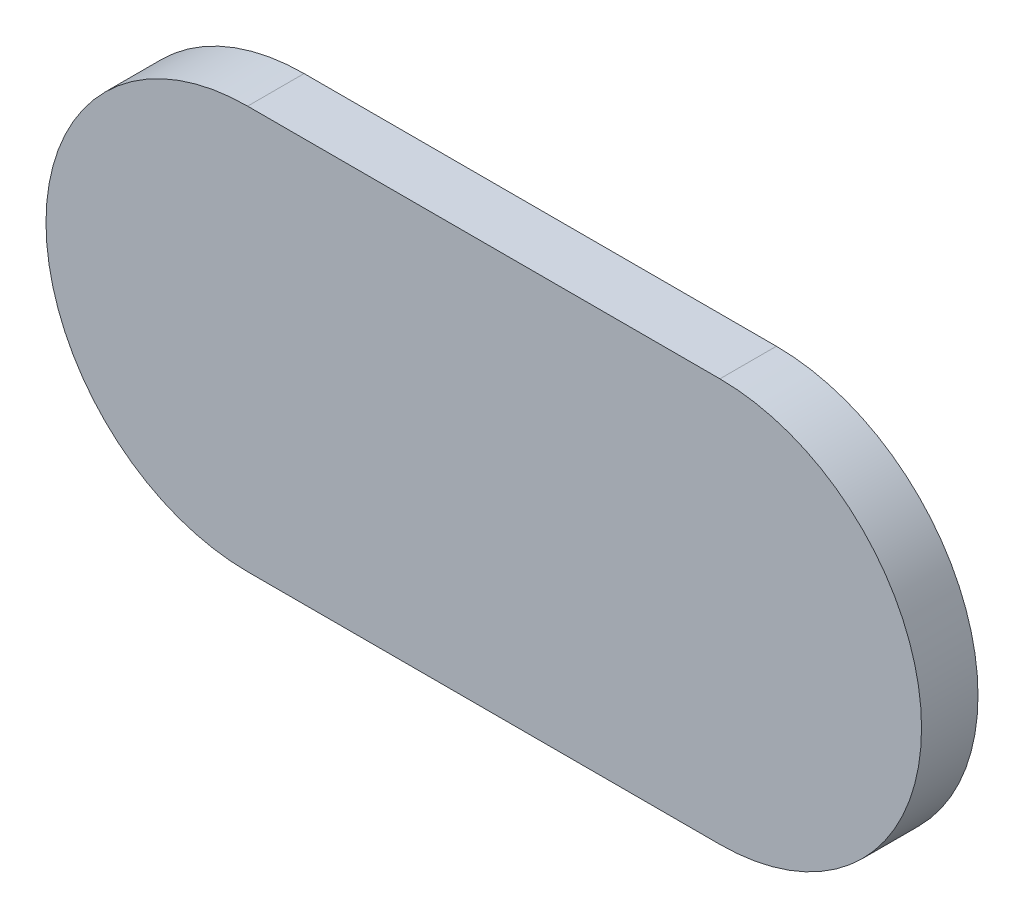
ISO-10303-21;
HEADER;
FILE_DESCRIPTION(('STEP AP214'),'2;1');
FILE_NAME('part.step','',(''),(''),'','','');
FILE_SCHEMA(('AUTOMOTIVE_DESIGN { 1 0 10303 214 1 1 1 1 }'));
ENDSEC;
DATA;
#1=APPLICATION_CONTEXT('core data for automotive mechanical design processes');
#2=APPLICATION_PROTOCOL_DEFINITION('international standard','automotive_design',2000,#1);
#3=PRODUCT_CONTEXT('',#1,'mechanical');
#4=PRODUCT('Part','Part','',(#3));
#5=PRODUCT_RELATED_PRODUCT_CATEGORY('part','',(#4));
#6=PRODUCT_DEFINITION_FORMATION('','',#4);
#7=PRODUCT_DEFINITION_CONTEXT('part definition',#1,'design');
#8=PRODUCT_DEFINITION('design','',#6,#7);
#9=PRODUCT_DEFINITION_SHAPE('','',#8);
#10=(LENGTH_UNIT() NAMED_UNIT(*) SI_UNIT(.MILLI.,.METRE.));
#11=(NAMED_UNIT(*) PLANE_ANGLE_UNIT() SI_UNIT($,.RADIAN.));
#12=(NAMED_UNIT(*) SI_UNIT($,.STERADIAN.) SOLID_ANGLE_UNIT());
#13=UNCERTAINTY_MEASURE_WITH_UNIT(LENGTH_MEASURE(1.E-05),#10,'distance_accuracy_value','');
#14=(GEOMETRIC_REPRESENTATION_CONTEXT(3) GLOBAL_UNCERTAINTY_ASSIGNED_CONTEXT((#13)) GLOBAL_UNIT_ASSIGNED_CONTEXT((#10,
#11,#12)) REPRESENTATION_CONTEXT('',''));
#15=CARTESIAN_POINT('',(0.,0.,0.));
#16=DIRECTION('',(0.,0.,1.));
#17=DIRECTION('',(1.,0.,0.));
#18=AXIS2_PLACEMENT_3D('',#15,#16,#17);
#19=CARTESIAN_POINT('',(86.92152796,101.0600468,0.));
#20=DIRECTION('',(0.,1.,0.));
#21=DIRECTION('',(1.,0.,0.));
#22=AXIS2_PLACEMENT_3D('',#19,#20,#21);
#23=PLANE('',#22);
#24=DIRECTION('',(1.,0.,0.));
#25=VECTOR('',#24,1.);
#26=CARTESIAN_POINT('',(86.92152796,101.0600468,0.03556));
#27=LINE('',#26,#25);
#28=CARTESIAN_POINT('',(86.92152796,101.0600468,0.03556));
#29=VERTEX_POINT('',#28);
#30=CARTESIAN_POINT('',(87.219028,101.0600468,0.03556));
#31=VERTEX_POINT('',#30);
#32=EDGE_CURVE('E11',#29,#31,#27,.T.);
#33=ORIENTED_EDGE('',*,*,#32,.F.);
#34=DIRECTION('',(0.,0.,1.));
#35=VECTOR('',#34,1.);
#36=CARTESIAN_POINT('',(86.92152796,101.0600468,0.));
#37=LINE('',#36,#35);
#38=CARTESIAN_POINT('',(86.92152796,101.0600468,0.));
#39=VERTEX_POINT('',#38);
#40=EDGE_CURVE('E24',#39,#29,#37,.T.);
#41=ORIENTED_EDGE('',*,*,#40,.F.);
#42=DIRECTION('',(1.,0.,0.));
#43=VECTOR('',#42,1.);
#44=CARTESIAN_POINT('',(86.92152796,101.0600468,0.));
#45=LINE('',#44,#43);
#46=CARTESIAN_POINT('',(87.219028,101.0600468,0.));
#47=VERTEX_POINT('',#46);
#48=EDGE_CURVE('E75',#39,#47,#45,.T.);
#49=ORIENTED_EDGE('',*,*,#48,.T.);
#50=DIRECTION('',(0.,0.,1.));
#51=VECTOR('',#50,1.);
#52=CARTESIAN_POINT('',(87.219028,101.0600468,0.));
#53=LINE('',#52,#51);
#54=EDGE_CURVE('E37',#47,#31,#53,.T.);
#55=ORIENTED_EDGE('',*,*,#54,.T.);
#56=EDGE_LOOP('',(#33,#41,#49,#55));
#57=FACE_BOUND('',#56,.T.);
#58=ADVANCED_FACE('F17',(#57),#23,.F.);
#59=CARTESIAN_POINT('',(87.219028,101.1870468,0.));
#60=DIRECTION('',(0.,0.,-1.));
#61=DIRECTION('',(1.11896493820492E-13,-1.,0.));
#62=AXIS2_PLACEMENT_3D('',#59,#60,#61);
#63=CYLINDRICAL_SURFACE('',#62,0.127000000000005);
#64=CARTESIAN_POINT('',(87.219028,101.1870468,0.03556));
#65=DIRECTION('',(0.,0.,1.));
#66=DIRECTION('',(1.11896493820492E-13,-1.,0.));
#67=AXIS2_PLACEMENT_3D('',#64,#65,#66);
#68=CIRCLE('',#67,0.127000000000005);
#69=CARTESIAN_POINT('',(87.219028,101.3140468,0.03556));
#70=VERTEX_POINT('',#69);
#71=EDGE_CURVE('E83',#31,#70,#68,.T.);
#72=ORIENTED_EDGE('',*,*,#71,.F.);
#73=ORIENTED_EDGE('',*,*,#54,.F.);
#74=CARTESIAN_POINT('',(87.219028,101.1870468,0.));
#75=DIRECTION('',(0.,0.,1.));
#76=DIRECTION('',(1.11896493820492E-13,-1.,0.));
#77=AXIS2_PLACEMENT_3D('',#74,#75,#76);
#78=CIRCLE('',#77,0.127000000000005);
#79=CARTESIAN_POINT('',(87.219028,101.3140468,0.));
#80=VERTEX_POINT('',#79);
#81=EDGE_CURVE('E81',#47,#80,#78,.T.);
#82=ORIENTED_EDGE('',*,*,#81,.T.);
#83=DIRECTION('',(0.,0.,1.));
#84=VECTOR('',#83,1.);
#85=CARTESIAN_POINT('',(87.219028,101.3140468,0.));
#86=LINE('',#85,#84);
#87=EDGE_CURVE('E67',#80,#70,#86,.T.);
#88=ORIENTED_EDGE('',*,*,#87,.T.);
#89=EDGE_LOOP('',(#72,#73,#82,#88));
#90=FACE_BOUND('',#89,.T.);
#91=ADVANCED_FACE('F89',(#90),#63,.T.);
#92=CARTESIAN_POINT('',(87.219028,101.3140468,0.));
#93=DIRECTION('',(0.,-1.,0.));
#94=DIRECTION('',(-1.,0.,0.));
#95=AXIS2_PLACEMENT_3D('',#92,#93,#94);
#96=PLANE('',#95);
#97=DIRECTION('',(-1.,0.,0.));
#98=VECTOR('',#97,1.);
#99=CARTESIAN_POINT('',(87.219028,101.3140468,0.03556));
#100=LINE('',#99,#98);
#101=CARTESIAN_POINT('',(86.92152796,101.3140468,0.03556));
#102=VERTEX_POINT('',#101);
#103=EDGE_CURVE('E71',#70,#102,#100,.T.);
#104=ORIENTED_EDGE('',*,*,#103,.F.);
#105=ORIENTED_EDGE('',*,*,#87,.F.);
#106=DIRECTION('',(-1.,0.,0.));
#107=VECTOR('',#106,1.);
#108=CARTESIAN_POINT('',(87.219028,101.3140468,0.));
#109=LINE('',#108,#107);
#110=CARTESIAN_POINT('',(86.92152796,101.3140468,0.));
#111=VERTEX_POINT('',#110);
#112=EDGE_CURVE('E63',#80,#111,#109,.T.);
#113=ORIENTED_EDGE('',*,*,#112,.T.);
#114=DIRECTION('',(0.,0.,1.));
#115=VECTOR('',#114,1.);
#116=CARTESIAN_POINT('',(86.92152796,101.3140468,0.));
#117=LINE('',#116,#115);
#118=EDGE_CURVE('E53',#111,#102,#117,.T.);
#119=ORIENTED_EDGE('',*,*,#118,.T.);
#120=EDGE_LOOP('',(#104,#105,#113,#119));
#121=FACE_BOUND('',#120,.T.);
#122=ADVANCED_FACE('F66',(#121),#96,.F.);
#123=CARTESIAN_POINT('',(86.92152796,101.1870468,0.));
#124=DIRECTION('',(0.,0.,-1.));
#125=DIRECTION('',(1.1189649382048E-13,1.,0.));
#126=AXIS2_PLACEMENT_3D('',#123,#124,#125);
#127=CYLINDRICAL_SURFACE('',#126,0.127);
#128=CARTESIAN_POINT('',(86.92152796,101.1870468,0.03556));
#129=DIRECTION('',(0.,0.,1.));
#130=DIRECTION('',(1.1189649382048E-13,1.,0.));
#131=AXIS2_PLACEMENT_3D('',#128,#129,#130);
#132=CIRCLE('',#131,0.127);
#133=EDGE_CURVE('E59',#102,#29,#132,.T.);
#134=ORIENTED_EDGE('',*,*,#133,.F.);
#135=ORIENTED_EDGE('',*,*,#118,.F.);
#136=CARTESIAN_POINT('',(86.92152796,101.1870468,0.));
#137=DIRECTION('',(0.,0.,1.));
#138=DIRECTION('',(1.1189649382048E-13,1.,0.));
#139=AXIS2_PLACEMENT_3D('',#136,#137,#138);
#140=CIRCLE('',#139,0.127);
#141=EDGE_CURVE('E57',#111,#39,#140,.T.);
#142=ORIENTED_EDGE('',*,*,#141,.T.);
#143=ORIENTED_EDGE('',*,*,#40,.T.);
#144=EDGE_LOOP('',(#134,#135,#142,#143));
#145=FACE_BOUND('',#144,.T.);
#146=ADVANCED_FACE('F55',(#145),#127,.T.);
#147=CARTESIAN_POINT('',(86.92152796,101.0600468,0.));
#148=DIRECTION('',(0.,0.,-1.));
#149=DIRECTION('',(-1.,0.,0.));
#150=AXIS2_PLACEMENT_3D('',#147,#148,#149);
#151=PLANE('',#150);
#152=ORIENTED_EDGE('',*,*,#141,.F.);
#153=ORIENTED_EDGE('',*,*,#112,.F.);
#154=ORIENTED_EDGE('',*,*,#81,.F.);
#155=ORIENTED_EDGE('',*,*,#48,.F.);
#156=EDGE_LOOP('',(#152,#153,#154,#155));
#157=FACE_BOUND('',#156,.T.);
#158=ADVANCED_FACE('F74',(#157),#151,.T.);
#159=CARTESIAN_POINT('',(86.92152796,101.0600468,0.03556));
#160=DIRECTION('',(0.,0.,-1.));
#161=DIRECTION('',(-1.,0.,0.));
#162=AXIS2_PLACEMENT_3D('',#159,#160,#161);
#163=PLANE('',#162);
#164=ORIENTED_EDGE('',*,*,#32,.T.);
#165=ORIENTED_EDGE('',*,*,#71,.T.);
#166=ORIENTED_EDGE('',*,*,#103,.T.);
#167=ORIENTED_EDGE('',*,*,#133,.T.);
#168=EDGE_LOOP('',(#164,#165,#166,#167));
#169=FACE_BOUND('',#168,.T.);
#170=ADVANCED_FACE('F91',(#169),#163,.F.);
#171=CLOSED_SHELL('',(#58,#91,#122,#146,#158,#170));
#172=MANIFOLD_SOLID_BREP('B1',#171);
#173=ADVANCED_BREP_SHAPE_REPRESENTATION('',(#18,#172),#14);
#174=SHAPE_DEFINITION_REPRESENTATION(#9,#173);
ENDSEC;
END-ISO-10303-21;
